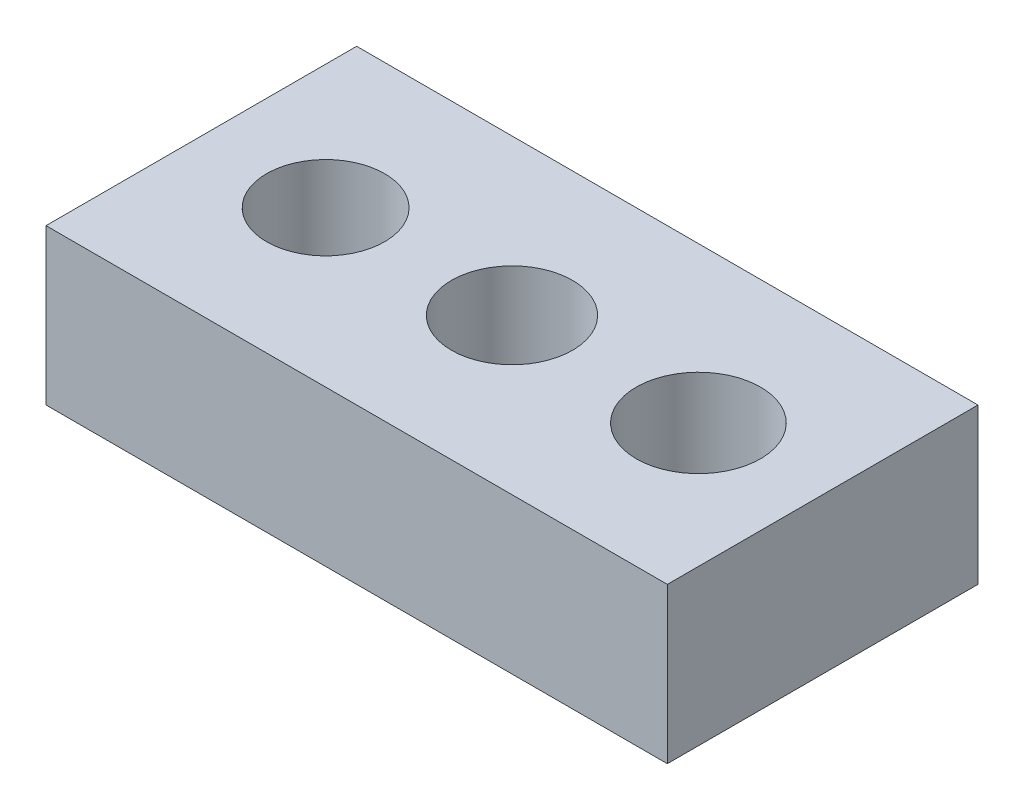
ISO-10303-21;
HEADER;
FILE_DESCRIPTION(('STEP AP214'),'2;1');
FILE_NAME('part.step','',(''),(''),'','','');
FILE_SCHEMA(('AUTOMOTIVE_DESIGN { 1 0 10303 214 1 1 1 1 }'));
ENDSEC;
DATA;
#1=APPLICATION_CONTEXT('core data for automotive mechanical design processes');
#2=APPLICATION_PROTOCOL_DEFINITION('international standard','automotive_design',2000,#1);
#3=PRODUCT_CONTEXT('',#1,'mechanical');
#4=PRODUCT('Part','Part','',(#3));
#5=PRODUCT_RELATED_PRODUCT_CATEGORY('part','',(#4));
#6=PRODUCT_DEFINITION_FORMATION('','',#4);
#7=PRODUCT_DEFINITION_CONTEXT('part definition',#1,'design');
#8=PRODUCT_DEFINITION('design','',#6,#7);
#9=PRODUCT_DEFINITION_SHAPE('','',#8);
#10=(LENGTH_UNIT() NAMED_UNIT(*) SI_UNIT(.MILLI.,.METRE.));
#11=(NAMED_UNIT(*) PLANE_ANGLE_UNIT() SI_UNIT($,.RADIAN.));
#12=(NAMED_UNIT(*) SI_UNIT($,.STERADIAN.) SOLID_ANGLE_UNIT());
#13=UNCERTAINTY_MEASURE_WITH_UNIT(LENGTH_MEASURE(1.E-05),#10,'distance_accuracy_value','');
#14=(GEOMETRIC_REPRESENTATION_CONTEXT(3) GLOBAL_UNCERTAINTY_ASSIGNED_CONTEXT((#13)) GLOBAL_UNIT_ASSIGNED_CONTEXT((#10,
#11,#12)) REPRESENTATION_CONTEXT('',''));
#15=CARTESIAN_POINT('',(0.,0.,0.));
#16=DIRECTION('',(0.,0.,1.));
#17=DIRECTION('',(1.,0.,0.));
#18=AXIS2_PLACEMENT_3D('',#15,#16,#17);
#19=CARTESIAN_POINT('',(0.,5.,0.));
#20=DIRECTION('',(1.,0.,0.));
#21=DIRECTION('',(0.,0.,-1.));
#22=AXIS2_PLACEMENT_3D('',#19,#20,#21);
#23=PLANE('',#22);
#24=DIRECTION('',(0.,0.,1.));
#25=VECTOR('',#24,1.);
#26=CARTESIAN_POINT('',(0.,0.,0.));
#27=LINE('',#26,#25);
#28=CARTESIAN_POINT('',(0.,0.,-10.));
#29=VERTEX_POINT('',#28);
#30=CARTESIAN_POINT('',(0.,0.,0.));
#31=VERTEX_POINT('',#30);
#32=EDGE_CURVE('E107',#29,#31,#27,.T.);
#33=ORIENTED_EDGE('',*,*,#32,.T.);
#34=DIRECTION('',(0.,-1.,0.));
#35=VECTOR('',#34,1.);
#36=CARTESIAN_POINT('',(0.,5.,0.));
#37=LINE('',#36,#35);
#38=CARTESIAN_POINT('',(0.,5.,0.));
#39=VERTEX_POINT('',#38);
#40=EDGE_CURVE('E11',#39,#31,#37,.T.);
#41=ORIENTED_EDGE('',*,*,#40,.F.);
#42=DIRECTION('',(0.,0.,1.));
#43=VECTOR('',#42,1.);
#44=CARTESIAN_POINT('',(0.,5.,0.));
#45=LINE('',#44,#43);
#46=CARTESIAN_POINT('',(0.,5.,-10.));
#47=VERTEX_POINT('',#46);
#48=EDGE_CURVE('E91',#47,#39,#45,.T.);
#49=ORIENTED_EDGE('',*,*,#48,.F.);
#50=DIRECTION('',(0.,-1.,0.));
#51=VECTOR('',#50,1.);
#52=CARTESIAN_POINT('',(0.,5.,-10.));
#53=LINE('',#52,#51);
#54=EDGE_CURVE('E103',#47,#29,#53,.T.);
#55=ORIENTED_EDGE('',*,*,#54,.T.);
#56=EDGE_LOOP('',(#33,#41,#49,#55));
#57=FACE_BOUND('',#56,.T.);
#58=ADVANCED_FACE('F39',(#57),#23,.F.);
#59=CARTESIAN_POINT('',(0.,5.,0.));
#60=DIRECTION('',(0.,0.,-1.));
#61=DIRECTION('',(-1.,0.,0.));
#62=AXIS2_PLACEMENT_3D('',#59,#60,#61);
#63=PLANE('',#62);
#64=DIRECTION('',(1.,0.,0.));
#65=VECTOR('',#64,1.);
#66=CARTESIAN_POINT('',(0.,0.,0.));
#67=LINE('',#66,#65);
#68=CARTESIAN_POINT('',(20.,0.,0.));
#69=VERTEX_POINT('',#68);
#70=EDGE_CURVE('E96',#31,#69,#67,.T.);
#71=ORIENTED_EDGE('',*,*,#70,.T.);
#72=DIRECTION('',(0.,-1.,0.));
#73=VECTOR('',#72,1.);
#74=CARTESIAN_POINT('',(20.,5.,0.));
#75=LINE('',#74,#73);
#76=CARTESIAN_POINT('',(20.,5.,0.));
#77=VERTEX_POINT('',#76);
#78=EDGE_CURVE('E48',#77,#69,#75,.T.);
#79=ORIENTED_EDGE('',*,*,#78,.F.);
#80=DIRECTION('',(1.,0.,0.));
#81=VECTOR('',#80,1.);
#82=CARTESIAN_POINT('',(0.,5.,0.));
#83=LINE('',#82,#81);
#84=EDGE_CURVE('E86',#39,#77,#83,.T.);
#85=ORIENTED_EDGE('',*,*,#84,.F.);
#86=ORIENTED_EDGE('',*,*,#40,.T.);
#87=EDGE_LOOP('',(#71,#79,#85,#86));
#88=FACE_BOUND('',#87,.T.);
#89=ADVANCED_FACE('F95',(#88),#63,.F.);
#90=CARTESIAN_POINT('',(20.,5.,0.));
#91=DIRECTION('',(-1.,0.,0.));
#92=DIRECTION('',(0.,0.,1.));
#93=AXIS2_PLACEMENT_3D('',#90,#91,#92);
#94=PLANE('',#93);
#95=DIRECTION('',(0.,0.,-1.));
#96=VECTOR('',#95,1.);
#97=CARTESIAN_POINT('',(20.,0.,0.));
#98=LINE('',#97,#96);
#99=CARTESIAN_POINT('',(20.,0.,-10.));
#100=VERTEX_POINT('',#99);
#101=EDGE_CURVE('E73',#69,#100,#98,.T.);
#102=ORIENTED_EDGE('',*,*,#101,.T.);
#103=DIRECTION('',(0.,-1.,0.));
#104=VECTOR('',#103,1.);
#105=CARTESIAN_POINT('',(20.,5.,-10.));
#106=LINE('',#105,#104);
#107=CARTESIAN_POINT('',(20.,5.,-10.));
#108=VERTEX_POINT('',#107);
#109=EDGE_CURVE('E98',#108,#100,#106,.T.);
#110=ORIENTED_EDGE('',*,*,#109,.F.);
#111=DIRECTION('',(0.,0.,-1.));
#112=VECTOR('',#111,1.);
#113=CARTESIAN_POINT('',(20.,5.,0.));
#114=LINE('',#113,#112);
#115=EDGE_CURVE('E89',#77,#108,#114,.T.);
#116=ORIENTED_EDGE('',*,*,#115,.F.);
#117=ORIENTED_EDGE('',*,*,#78,.T.);
#118=EDGE_LOOP('',(#102,#110,#116,#117));
#119=FACE_BOUND('',#118,.T.);
#120=ADVANCED_FACE('F99',(#119),#94,.F.);
#121=CARTESIAN_POINT('',(0.,5.,-10.));
#122=DIRECTION('',(0.,0.,1.));
#123=DIRECTION('',(1.,0.,0.));
#124=AXIS2_PLACEMENT_3D('',#121,#122,#123);
#125=PLANE('',#124);
#126=DIRECTION('',(-1.,0.,0.));
#127=VECTOR('',#126,1.);
#128=CARTESIAN_POINT('',(0.,0.,-10.));
#129=LINE('',#128,#127);
#130=EDGE_CURVE('E79',#100,#29,#129,.T.);
#131=ORIENTED_EDGE('',*,*,#130,.T.);
#132=ORIENTED_EDGE('',*,*,#54,.F.);
#133=DIRECTION('',(-1.,0.,0.));
#134=VECTOR('',#133,1.);
#135=CARTESIAN_POINT('',(0.,5.,-10.));
#136=LINE('',#135,#134);
#137=EDGE_CURVE('E56',#108,#47,#136,.T.);
#138=ORIENTED_EDGE('',*,*,#137,.F.);
#139=ORIENTED_EDGE('',*,*,#109,.T.);
#140=EDGE_LOOP('',(#131,#132,#138,#139));
#141=FACE_BOUND('',#140,.T.);
#142=ADVANCED_FACE('F121',(#141),#125,.F.);
#143=CARTESIAN_POINT('',(0.,5.,0.));
#144=DIRECTION('',(0.,-1.,0.));
#145=DIRECTION('',(0.,0.,-1.));
#146=AXIS2_PLACEMENT_3D('',#143,#144,#145);
#147=PLANE('',#146);
#148=CARTESIAN_POINT('',(16.,5.,-5.));
#149=DIRECTION('',(0.,1.,0.));
#150=DIRECTION('',(0.,0.,1.));
#151=AXIS2_PLACEMENT_3D('',#148,#149,#150);
#152=CIRCLE('',#151,2.);
#153=CARTESIAN_POINT('',(16.,5.,-3.));
#154=VERTEX_POINT('',#153);
#155=EDGE_CURVE('E147',#154,#154,#152,.T.);
#156=ORIENTED_EDGE('',*,*,#155,.F.);
#157=EDGE_LOOP('',(#156));
#158=FACE_BOUND('',#157,.T.);
#159=CARTESIAN_POINT('',(10.,5.,-5.));
#160=DIRECTION('',(0.,1.,0.));
#161=DIRECTION('',(0.,0.,1.));
#162=AXIS2_PLACEMENT_3D('',#159,#160,#161);
#163=CIRCLE('',#162,1.95);
#164=CARTESIAN_POINT('',(10.,5.,-3.05));
#165=VERTEX_POINT('',#164);
#166=EDGE_CURVE('E139',#165,#165,#163,.T.);
#167=ORIENTED_EDGE('',*,*,#166,.F.);
#168=EDGE_LOOP('',(#167));
#169=FACE_BOUND('',#168,.T.);
#170=CARTESIAN_POINT('',(4.,5.,-5.));
#171=DIRECTION('',(0.,1.,0.));
#172=DIRECTION('',(0.,0.,1.));
#173=AXIS2_PLACEMENT_3D('',#170,#171,#172);
#174=CIRCLE('',#173,1.89999999999999);
#175=CARTESIAN_POINT('',(4.,5.,-3.10000000000001));
#176=VERTEX_POINT('',#175);
#177=EDGE_CURVE('E131',#176,#176,#174,.T.);
#178=ORIENTED_EDGE('',*,*,#177,.F.);
#179=EDGE_LOOP('',(#178));
#180=FACE_BOUND('',#179,.T.);
#181=ORIENTED_EDGE('',*,*,#48,.T.);
#182=ORIENTED_EDGE('',*,*,#84,.T.);
#183=ORIENTED_EDGE('',*,*,#115,.T.);
#184=ORIENTED_EDGE('',*,*,#137,.T.);
#185=EDGE_LOOP('',(#181,#182,#183,#184));
#186=FACE_BOUND('',#185,.T.);
#187=ADVANCED_FACE('F87',(#158,#169,#180,#186),#147,.F.);
#188=CARTESIAN_POINT('',(0.,0.,0.));
#189=DIRECTION('',(0.,-1.,0.));
#190=DIRECTION('',(0.,0.,-1.));
#191=AXIS2_PLACEMENT_3D('',#188,#189,#190);
#192=PLANE('',#191);
#193=CARTESIAN_POINT('',(16.,0.,-5.));
#194=DIRECTION('',(0.,1.,0.));
#195=DIRECTION('',(0.,0.,1.));
#196=AXIS2_PLACEMENT_3D('',#193,#194,#195);
#197=CIRCLE('',#196,2.);
#198=CARTESIAN_POINT('',(16.,0.,-3.));
#199=VERTEX_POINT('',#198);
#200=EDGE_CURVE('E143',#199,#199,#197,.T.);
#201=ORIENTED_EDGE('',*,*,#200,.T.);
#202=EDGE_LOOP('',(#201));
#203=FACE_BOUND('',#202,.T.);
#204=CARTESIAN_POINT('',(10.,0.,-5.));
#205=DIRECTION('',(0.,1.,0.));
#206=DIRECTION('',(0.,0.,1.));
#207=AXIS2_PLACEMENT_3D('',#204,#205,#206);
#208=CIRCLE('',#207,1.95);
#209=CARTESIAN_POINT('',(10.,0.,-3.05));
#210=VERTEX_POINT('',#209);
#211=EDGE_CURVE('E135',#210,#210,#208,.T.);
#212=ORIENTED_EDGE('',*,*,#211,.T.);
#213=EDGE_LOOP('',(#212));
#214=FACE_BOUND('',#213,.T.);
#215=CARTESIAN_POINT('',(4.,0.,-5.));
#216=DIRECTION('',(0.,1.,0.));
#217=DIRECTION('',(0.,0.,1.));
#218=AXIS2_PLACEMENT_3D('',#215,#216,#217);
#219=CIRCLE('',#218,1.89999999999999);
#220=CARTESIAN_POINT('',(4.,0.,-3.10000000000001));
#221=VERTEX_POINT('',#220);
#222=EDGE_CURVE('E111',#221,#221,#219,.T.);
#223=ORIENTED_EDGE('',*,*,#222,.T.);
#224=EDGE_LOOP('',(#223));
#225=FACE_BOUND('',#224,.T.);
#226=ORIENTED_EDGE('',*,*,#32,.F.);
#227=ORIENTED_EDGE('',*,*,#130,.F.);
#228=ORIENTED_EDGE('',*,*,#101,.F.);
#229=ORIENTED_EDGE('',*,*,#70,.F.);
#230=EDGE_LOOP('',(#226,#227,#228,#229));
#231=FACE_BOUND('',#230,.T.);
#232=ADVANCED_FACE('F124',(#203,#214,#225,#231),#192,.T.);
#233=CARTESIAN_POINT('',(4.,5.,-5.));
#234=DIRECTION('',(0.,1.,0.));
#235=DIRECTION('',(0.,0.,1.));
#236=AXIS2_PLACEMENT_3D('',#233,#234,#235);
#237=CYLINDRICAL_SURFACE('',#236,1.89999999999999);
#238=ORIENTED_EDGE('',*,*,#222,.F.);
#239=EDGE_LOOP('',(#238));
#240=FACE_BOUND('',#239,.T.);
#241=ORIENTED_EDGE('',*,*,#177,.T.);
#242=EDGE_LOOP('',(#241));
#243=FACE_BOUND('',#242,.T.);
#244=ADVANCED_FACE('F161',(#240,#243),#237,.F.);
#245=CARTESIAN_POINT('',(10.,5.,-5.));
#246=DIRECTION('',(0.,1.,0.));
#247=DIRECTION('',(0.,0.,1.));
#248=AXIS2_PLACEMENT_3D('',#245,#246,#247);
#249=CYLINDRICAL_SURFACE('',#248,1.95);
#250=ORIENTED_EDGE('',*,*,#211,.F.);
#251=EDGE_LOOP('',(#250));
#252=FACE_BOUND('',#251,.T.);
#253=ORIENTED_EDGE('',*,*,#166,.T.);
#254=EDGE_LOOP('',(#253));
#255=FACE_BOUND('',#254,.T.);
#256=ADVANCED_FACE('F163',(#252,#255),#249,.F.);
#257=CARTESIAN_POINT('',(16.,5.,-5.));
#258=DIRECTION('',(0.,1.,0.));
#259=DIRECTION('',(0.,0.,1.));
#260=AXIS2_PLACEMENT_3D('',#257,#258,#259);
#261=CYLINDRICAL_SURFACE('',#260,2.);
#262=ORIENTED_EDGE('',*,*,#200,.F.);
#263=EDGE_LOOP('',(#262));
#264=FACE_BOUND('',#263,.T.);
#265=ORIENTED_EDGE('',*,*,#155,.T.);
#266=EDGE_LOOP('',(#265));
#267=FACE_BOUND('',#266,.T.);
#268=ADVANCED_FACE('F152',(#264,#267),#261,.F.);
#269=CLOSED_SHELL('',(#58,#89,#120,#142,#187,#232,#244,#256,#268));
#270=MANIFOLD_SOLID_BREP('B2',#269);
#271=ADVANCED_BREP_SHAPE_REPRESENTATION('',(#18,#270),#14);
#272=SHAPE_DEFINITION_REPRESENTATION(#9,#271);
ENDSEC;
END-ISO-10303-21;
